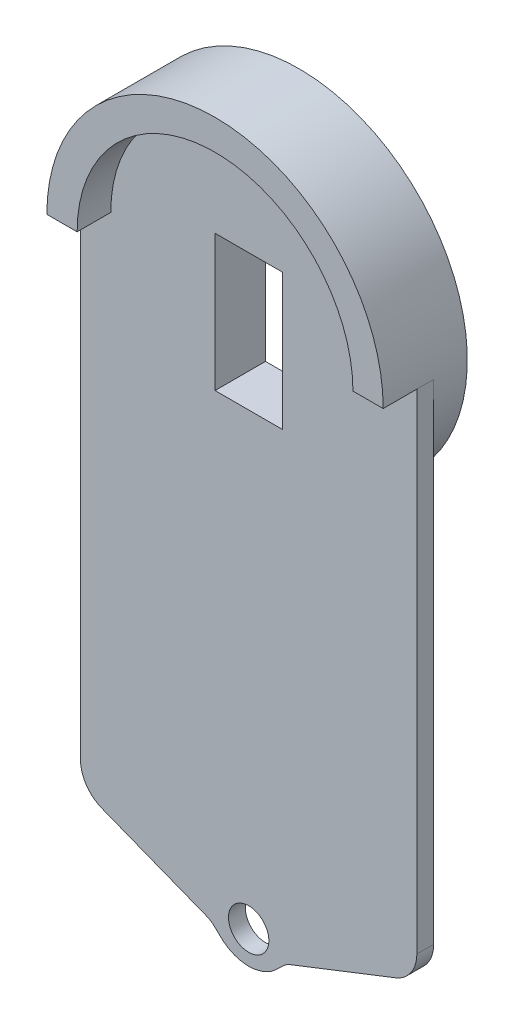
ISO-10303-21;
HEADER;
FILE_DESCRIPTION(('STEP AP214'),'2;1');
FILE_NAME('part.step','',(''),(''),'','','');
FILE_SCHEMA(('AUTOMOTIVE_DESIGN { 1 0 10303 214 1 1 1 1 }'));
ENDSEC;
DATA;
#1=APPLICATION_CONTEXT('core data for automotive mechanical design processes');
#2=APPLICATION_PROTOCOL_DEFINITION('international standard','automotive_design',2000,#1);
#3=PRODUCT_CONTEXT('',#1,'mechanical');
#4=PRODUCT('Part','Part','',(#3));
#5=PRODUCT_RELATED_PRODUCT_CATEGORY('part','',(#4));
#6=PRODUCT_DEFINITION_FORMATION('','',#4);
#7=PRODUCT_DEFINITION_CONTEXT('part definition',#1,'design');
#8=PRODUCT_DEFINITION('design','',#6,#7);
#9=PRODUCT_DEFINITION_SHAPE('','',#8);
#10=(LENGTH_UNIT() NAMED_UNIT(*) SI_UNIT(.MILLI.,.METRE.));
#11=(NAMED_UNIT(*) PLANE_ANGLE_UNIT() SI_UNIT($,.RADIAN.));
#12=(NAMED_UNIT(*) SI_UNIT($,.STERADIAN.) SOLID_ANGLE_UNIT());
#13=UNCERTAINTY_MEASURE_WITH_UNIT(LENGTH_MEASURE(1.E-05),#10,'distance_accuracy_value','');
#14=(GEOMETRIC_REPRESENTATION_CONTEXT(3) GLOBAL_UNCERTAINTY_ASSIGNED_CONTEXT((#13)) GLOBAL_UNIT_ASSIGNED_CONTEXT((#10,
#11,#12)) REPRESENTATION_CONTEXT('',''));
#15=CARTESIAN_POINT('',(0.,0.,0.));
#16=DIRECTION('',(0.,0.,1.));
#17=DIRECTION('',(1.,0.,0.));
#18=AXIS2_PLACEMENT_3D('',#15,#16,#17);
#19=CARTESIAN_POINT('',(0.,0.,0.));
#20=DIRECTION('',(0.,0.,1.));
#21=DIRECTION('',(1.,0.,0.));
#22=AXIS2_PLACEMENT_3D('',#19,#20,#21);
#23=PLANE('',#22);
#24=CARTESIAN_POINT('',(0.,0.,0.));
#25=DIRECTION('',(0.,0.,1.));
#26=DIRECTION('',(1.,0.,0.));
#27=AXIS2_PLACEMENT_3D('',#24,#25,#26);
#28=CIRCLE('',#27,6.00000000000001);
#29=CARTESIAN_POINT('',(6.00000000000001,0.,0.));
#30=VERTEX_POINT('',#29);
#31=EDGE_CURVE('E277',#30,#30,#28,.T.);
#32=ORIENTED_EDGE('',*,*,#31,.T.);
#33=EDGE_LOOP('',(#32));
#34=FACE_BOUND('',#33,.T.);
#35=CARTESIAN_POINT('',(0.,164.,0.));
#36=DIRECTION('',(0.,0.,-1.));
#37=DIRECTION('',(-1.,0.,0.));
#38=AXIS2_PLACEMENT_3D('',#35,#36,#37);
#39=CIRCLE('',#38,50.0000000000001);
#40=CARTESIAN_POINT('',(50.,164.,0.));
#41=VERTEX_POINT('',#40);
#42=CARTESIAN_POINT('',(-50.,164.,0.));
#43=VERTEX_POINT('',#42);
#44=EDGE_CURVE('E11',#41,#43,#39,.T.);
#45=ORIENTED_EDGE('',*,*,#44,.F.);
#46=DIRECTION('',(0.,-1.,0.));
#47=VECTOR('',#46,1.);
#48=CARTESIAN_POINT('',(50.,0.,0.));
#49=LINE('',#48,#47);
#50=CARTESIAN_POINT('',(50.,18.56450634185,0.));
#51=VERTEX_POINT('',#50);
#52=EDGE_CURVE('E352',#41,#51,#49,.T.);
#53=ORIENTED_EDGE('',*,*,#52,.T.);
#54=CARTESIAN_POINT('',(40.,18.56450634185,0.));
#55=DIRECTION('',(0.,0.,1.));
#56=DIRECTION('',(1.,0.,0.));
#57=AXIS2_PLACEMENT_3D('',#54,#55,#56);
#58=CIRCLE('',#57,10.);
#59=CARTESIAN_POINT('',(43.6440211842062,9.25208938334473,0.));
#60=VERTEX_POINT('',#59);
#61=EDGE_CURVE('E305',#51,#60,#58,.F.);
#62=ORIENTED_EDGE('',*,*,#61,.T.);
#63=DIRECTION('',(0.931241695850528,0.364402118420615,0.));
#64=VECTOR('',#63,1.);
#65=CARTESIAN_POINT('',(2.65577807818865,-6.7869289345908,0.));
#66=LINE('',#65,#64);
#67=CARTESIAN_POINT('',(13.7873085421709,-2.43107448733693,0.));
#68=VERTEX_POINT('',#67);
#69=EDGE_CURVE('E346',#68,#60,#66,.T.);
#70=ORIENTED_EDGE('',*,*,#69,.F.);
#71=CARTESIAN_POINT('',(8.85481718103053,-5.67730206584521,0.));
#72=CARTESIAN_POINT('',(9.51760474958754,-5.09034472237551,0.));
#73=CARTESIAN_POINT('',(10.9006542614922,-3.46904784150408,0.));
#74=CARTESIAN_POINT('',(12.7111603175639,-2.85217965748637,0.));
#75=CARTESIAN_POINT('',(13.7873085421709,-2.43107448733693,0.));
#76=B_SPLINE_CURVE_WITH_KNOTS('',3,(#71,#72,#73,#74,#75),.UNSPECIFIED.,.F.,.F.,(4,1,4),
(0.517708820762601,0.74117188397299,1.),.UNSPECIFIED.);
#77=CARTESIAN_POINT('',(8.85481718103053,-5.67730206584521,0.));
#78=VERTEX_POINT('',#77);
#79=EDGE_CURVE('E342',#78,#68,#76,.T.);
#80=ORIENTED_EDGE('',*,*,#79,.F.);
#81=CARTESIAN_POINT('',(0.,2.42159987766087,0.));
#82=DIRECTION('',(0.,0.,1.));
#83=DIRECTION('',(1.,0.,0.));
#84=AXIS2_PLACEMENT_3D('',#81,#82,#83);
#85=CIRCLE('',#84,12.);
#86=CARTESIAN_POINT('',(-8.85481718103054,-5.67730206584521,0.));
#87=VERTEX_POINT('',#86);
#88=EDGE_CURVE('E337',#87,#78,#85,.T.);
#89=ORIENTED_EDGE('',*,*,#88,.F.);
#90=CARTESIAN_POINT('',(-8.85481718103054,-5.67730206584521,0.));
#91=CARTESIAN_POINT('',(-9.51760474958754,-5.0903447223755,0.));
#92=CARTESIAN_POINT('',(-10.9006542614922,-3.46904784150407,0.));
#93=CARTESIAN_POINT('',(-12.7111603175639,-2.85217965748637,0.));
#94=CARTESIAN_POINT('',(-13.7873085421709,-2.43107448733693,0.));
#95=B_SPLINE_CURVE_WITH_KNOTS('',3,(#90,#91,#92,#93,#94),.UNSPECIFIED.,.F.,.F.,(4,1,4),
(0.517708820762602,0.74117188397299,1.),.UNSPECIFIED.);
#96=CARTESIAN_POINT('',(-13.7873085421709,-2.43107448733693,0.));
#97=VERTEX_POINT('',#96);
#98=EDGE_CURVE('E269',#87,#97,#95,.T.);
#99=ORIENTED_EDGE('',*,*,#98,.T.);
#100=DIRECTION('',(-0.931241695850529,0.364402118420615,0.));
#101=VECTOR('',#100,1.);
#102=CARTESIAN_POINT('',(-2.65577807818864,-6.78692893459079,0.));
#103=LINE('',#102,#101);
#104=CARTESIAN_POINT('',(-43.6440211842062,9.2520893833447,0.));
#105=VERTEX_POINT('',#104);
#106=EDGE_CURVE('E357',#97,#105,#103,.T.);
#107=ORIENTED_EDGE('',*,*,#106,.T.);
#108=CARTESIAN_POINT('',(-40.,18.56450634185,0.));
#109=DIRECTION('',(0.,0.,1.));
#110=DIRECTION('',(1.,0.,0.));
#111=AXIS2_PLACEMENT_3D('',#108,#109,#110);
#112=CIRCLE('',#111,10.);
#113=CARTESIAN_POINT('',(-50.,18.56450634185,0.));
#114=VERTEX_POINT('',#113);
#115=EDGE_CURVE('E380',#105,#114,#112,.F.);
#116=ORIENTED_EDGE('',*,*,#115,.T.);
#117=DIRECTION('',(0.,-1.,0.));
#118=VECTOR('',#117,1.);
#119=CARTESIAN_POINT('',(-50.,0.,0.));
#120=LINE('',#119,#118);
#121=EDGE_CURVE('E354',#43,#114,#120,.T.);
#122=ORIENTED_EDGE('',*,*,#121,.F.);
#123=EDGE_LOOP('',(#45,#53,#62,#70,#80,#89,#99,#107,#116,#122));
#124=FACE_BOUND('',#123,.T.);
#125=ADVANCED_FACE('F34',(#34,#124),#23,.F.);
#126=CARTESIAN_POINT('',(40.,18.56450634185,5.));
#127=DIRECTION('',(0.,0.,1.));
#128=DIRECTION('',(1.,0.,0.));
#129=AXIS2_PLACEMENT_3D('',#126,#127,#128);
#130=CYLINDRICAL_SURFACE('',#129,10.);
#131=DIRECTION('',(0.,0.,-1.));
#132=VECTOR('',#131,1.);
#133=CARTESIAN_POINT('',(50.,18.56450634185,5.));
#134=LINE('',#133,#132);
#135=CARTESIAN_POINT('',(50.,18.56450634185,5.));
#136=VERTEX_POINT('',#135);
#137=EDGE_CURVE('E300',#136,#51,#134,.T.);
#138=ORIENTED_EDGE('',*,*,#137,.F.);
#139=CARTESIAN_POINT('',(40.,18.56450634185,5.));
#140=DIRECTION('',(0.,0.,1.));
#141=DIRECTION('',(1.,0.,0.));
#142=AXIS2_PLACEMENT_3D('',#139,#140,#141);
#143=CIRCLE('',#142,10.);
#144=CARTESIAN_POINT('',(43.6440211842062,9.25208938334473,5.));
#145=VERTEX_POINT('',#144);
#146=EDGE_CURVE('E303',#145,#136,#143,.T.);
#147=ORIENTED_EDGE('',*,*,#146,.F.);
#148=DIRECTION('',(0.,0.,-1.));
#149=VECTOR('',#148,1.);
#150=CARTESIAN_POINT('',(43.6440211842062,9.25208938334472,5.));
#151=LINE('',#150,#149);
#152=EDGE_CURVE('E309',#60,#145,#151,.F.);
#153=ORIENTED_EDGE('',*,*,#152,.F.);
#154=ORIENTED_EDGE('',*,*,#61,.F.);
#155=EDGE_LOOP('',(#138,#147,#153,#154));
#156=FACE_BOUND('',#155,.T.);
#157=ADVANCED_FACE('F287',(#156),#130,.T.);
#158=CARTESIAN_POINT('',(-8.85481718103054,-5.67730206584521,5.));
#159=CARTESIAN_POINT('',(-9.51760474958754,-5.0903447223755,5.));
#160=CARTESIAN_POINT('',(-10.9006542614922,-3.46904784150407,5.));
#161=CARTESIAN_POINT('',(-12.7111603175639,-2.85217965748637,5.));
#162=CARTESIAN_POINT('',(-13.7873085421709,-2.43107448733693,5.));
#163=B_SPLINE_CURVE_WITH_KNOTS('',3,(#158,#159,#160,#161,#162),.UNSPECIFIED.,.F.,.F.,(4,1,4),
(0.517708820762602,0.74117188397299,1.),.UNSPECIFIED.);
#164=DIRECTION('',(0.,0.,-1.));
#165=VECTOR('',#164,1.);
#166=SURFACE_OF_LINEAR_EXTRUSION('',#163,#165);
#167=ORIENTED_EDGE('',*,*,#98,.F.);
#168=DIRECTION('',(0.,0.,-1.));
#169=VECTOR('',#168,1.);
#170=CARTESIAN_POINT('',(-8.85481718103054,-5.67730206584521,5.));
#171=LINE('',#170,#169);
#172=CARTESIAN_POINT('',(-8.85481718103054,-5.67730206584521,5.));
#173=VERTEX_POINT('',#172);
#174=EDGE_CURVE('E310',#173,#87,#171,.T.);
#175=ORIENTED_EDGE('',*,*,#174,.F.);
#176=CARTESIAN_POINT('',(-13.7873085421709,-2.43107448733693,5.));
#177=VERTEX_POINT('',#176);
#178=EDGE_CURVE('E270',#173,#177,#163,.T.);
#179=ORIENTED_EDGE('',*,*,#178,.T.);
#180=DIRECTION('',(0.,0.,-1.));
#181=VECTOR('',#180,1.);
#182=CARTESIAN_POINT('',(-13.7873085421709,-2.43107448733693,5.));
#183=LINE('',#182,#181);
#184=EDGE_CURVE('E332',#177,#97,#183,.T.);
#185=ORIENTED_EDGE('',*,*,#184,.T.);
#186=EDGE_LOOP('',(#167,#175,#179,#185));
#187=FACE_BOUND('',#186,.T.);
#188=ADVANCED_FACE('F283',(#187),#166,.T.);
#189=CARTESIAN_POINT('',(0.,2.42159987766087,5.));
#190=DIRECTION('',(0.,0.,-1.));
#191=DIRECTION('',(-1.,0.,0.));
#192=AXIS2_PLACEMENT_3D('',#189,#190,#191);
#193=CYLINDRICAL_SURFACE('',#192,12.);
#194=ORIENTED_EDGE('',*,*,#88,.T.);
#195=DIRECTION('',(0.,0.,-1.));
#196=VECTOR('',#195,1.);
#197=CARTESIAN_POINT('',(8.85481718103053,-5.67730206584521,5.));
#198=LINE('',#197,#196);
#199=CARTESIAN_POINT('',(8.85481718103053,-5.67730206584521,5.));
#200=VERTEX_POINT('',#199);
#201=EDGE_CURVE('E370',#200,#78,#198,.T.);
#202=ORIENTED_EDGE('',*,*,#201,.F.);
#203=CARTESIAN_POINT('',(0.,2.42159987766087,5.));
#204=DIRECTION('',(0.,0.,1.));
#205=DIRECTION('',(1.,0.,0.));
#206=AXIS2_PLACEMENT_3D('',#203,#204,#205);
#207=CIRCLE('',#206,12.);
#208=EDGE_CURVE('E276',#173,#200,#207,.T.);
#209=ORIENTED_EDGE('',*,*,#208,.F.);
#210=ORIENTED_EDGE('',*,*,#174,.T.);
#211=EDGE_LOOP('',(#194,#202,#209,#210));
#212=FACE_BOUND('',#211,.T.);
#213=ADVANCED_FACE('F286',(#212),#193,.T.);
#214=CARTESIAN_POINT('',(8.85481718103053,-5.67730206584521,5.));
#215=CARTESIAN_POINT('',(9.51760474958754,-5.09034472237551,5.));
#216=CARTESIAN_POINT('',(10.9006542614922,-3.46904784150408,5.));
#217=CARTESIAN_POINT('',(12.7111603175639,-2.85217965748637,5.));
#218=CARTESIAN_POINT('',(13.7873085421709,-2.43107448733693,5.));
#219=B_SPLINE_CURVE_WITH_KNOTS('',3,(#214,#215,#216,#217,#218),.UNSPECIFIED.,.F.,.F.,(4,1,4),
(0.517708820762601,0.74117188397299,1.),.UNSPECIFIED.);
#220=DIRECTION('',(0.,0.,-1.));
#221=VECTOR('',#220,1.);
#222=SURFACE_OF_LINEAR_EXTRUSION('',#219,#221);
#223=ORIENTED_EDGE('',*,*,#79,.T.);
#224=DIRECTION('',(0.,0.,-1.));
#225=VECTOR('',#224,1.);
#226=CARTESIAN_POINT('',(13.7873085421709,-2.43107448733693,5.));
#227=LINE('',#226,#225);
#228=CARTESIAN_POINT('',(13.7873085421709,-2.43107448733693,5.));
#229=VERTEX_POINT('',#228);
#230=EDGE_CURVE('E367',#229,#68,#227,.T.);
#231=ORIENTED_EDGE('',*,*,#230,.F.);
#232=EDGE_CURVE('E324',#200,#229,#219,.T.);
#233=ORIENTED_EDGE('',*,*,#232,.F.);
#234=ORIENTED_EDGE('',*,*,#201,.T.);
#235=EDGE_LOOP('',(#223,#231,#233,#234));
#236=FACE_BOUND('',#235,.T.);
#237=ADVANCED_FACE('F444',(#236),#222,.F.);
#238=CARTESIAN_POINT('',(2.65577807818865,-6.7869289345908,5.));
#239=DIRECTION('',(-0.364402118420615,0.931241695850528,0.));
#240=DIRECTION('',(-0.931241695850528,-0.364402118420615,0.));
#241=AXIS2_PLACEMENT_3D('',#238,#239,#240);
#242=PLANE('',#241);
#243=ORIENTED_EDGE('',*,*,#69,.T.);
#244=ORIENTED_EDGE('',*,*,#152,.T.);
#245=DIRECTION('',(0.931241695850528,0.364402118420615,0.));
#246=VECTOR('',#245,1.);
#247=CARTESIAN_POINT('',(2.65577807818865,-6.7869289345908,5.));
#248=LINE('',#247,#246);
#249=EDGE_CURVE('E318',#229,#145,#248,.T.);
#250=ORIENTED_EDGE('',*,*,#249,.F.);
#251=ORIENTED_EDGE('',*,*,#230,.T.);
#252=EDGE_LOOP('',(#243,#244,#250,#251));
#253=FACE_BOUND('',#252,.T.);
#254=ADVANCED_FACE('F442',(#253),#242,.F.);
#255=CARTESIAN_POINT('',(50.,0.,5.));
#256=DIRECTION('',(1.,0.,0.));
#257=DIRECTION('',(0.,0.,-1.));
#258=AXIS2_PLACEMENT_3D('',#255,#256,#257);
#259=PLANE('',#258);
#260=DIRECTION('',(0.,-1.,0.));
#261=VECTOR('',#260,1.);
#262=CARTESIAN_POINT('',(50.,0.,5.));
#263=LINE('',#262,#261);
#264=CARTESIAN_POINT('',(50.,164.,5.));
#265=VERTEX_POINT('',#264);
#266=EDGE_CURVE('E313',#265,#136,#263,.T.);
#267=ORIENTED_EDGE('',*,*,#266,.T.);
#268=ORIENTED_EDGE('',*,*,#137,.T.);
#269=ORIENTED_EDGE('',*,*,#52,.F.);
#270=DIRECTION('',(0.,0.,-1.));
#271=VECTOR('',#270,1.);
#272=CARTESIAN_POINT('',(50.,164.,5.));
#273=LINE('',#272,#271);
#274=EDGE_CURVE('E316',#265,#41,#273,.T.);
#275=ORIENTED_EDGE('',*,*,#274,.F.);
#276=EDGE_LOOP('',(#267,#268,#269,#275));
#277=FACE_BOUND('',#276,.T.);
#278=ADVANCED_FACE('F314',(#277),#259,.T.);
#279=CARTESIAN_POINT('',(0.,164.,5.));
#280=DIRECTION('',(0.,0.,-1.));
#281=DIRECTION('',(-1.,0.,0.));
#282=AXIS2_PLACEMENT_3D('',#279,#280,#281);
#283=CYLINDRICAL_SURFACE('',#282,50.);
#284=DIRECTION('',(0.,0.,-1.));
#285=VECTOR('',#284,1.);
#286=CARTESIAN_POINT('',(-50.,164.,5.));
#287=LINE('',#286,#285);
#288=CARTESIAN_POINT('',(-50.,164.,5.));
#289=VERTEX_POINT('',#288);
#290=EDGE_CURVE('E363',#289,#43,#287,.T.);
#291=ORIENTED_EDGE('',*,*,#290,.F.);
#292=DIRECTION('',(0.,0.,1.));
#293=VECTOR('',#292,1.);
#294=CARTESIAN_POINT('',(-50.,164.,5.));
#295=LINE('',#294,#293);
#296=CARTESIAN_POINT('',(-50.,164.,15.));
#297=VERTEX_POINT('',#296);
#298=EDGE_CURVE('E246',#289,#297,#295,.T.);
#299=ORIENTED_EDGE('',*,*,#298,.T.);
#300=CARTESIAN_POINT('',(0.,164.,15.));
#301=DIRECTION('',(0.,0.,1.));
#302=DIRECTION('',(1.,0.,0.));
#303=AXIS2_PLACEMENT_3D('',#300,#301,#302);
#304=CIRCLE('',#303,50.);
#305=CARTESIAN_POINT('',(50.,164.,15.));
#306=VERTEX_POINT('',#305);
#307=EDGE_CURVE('E265',#306,#297,#304,.T.);
#308=ORIENTED_EDGE('',*,*,#307,.F.);
#309=DIRECTION('',(0.,0.,1.));
#310=VECTOR('',#309,1.);
#311=CARTESIAN_POINT('',(50.,164.,5.));
#312=LINE('',#311,#310);
#313=EDGE_CURVE('E243',#265,#306,#312,.T.);
#314=ORIENTED_EDGE('',*,*,#313,.F.);
#315=ORIENTED_EDGE('',*,*,#274,.T.);
#316=ORIENTED_EDGE('',*,*,#44,.T.);
#317=EDGE_LOOP('',(#291,#299,#308,#314,#315,#316));
#318=FACE_BOUND('',#317,.T.);
#319=CARTESIAN_POINT('',(0.,164.,-10.));
#320=DIRECTION('',(0.,0.,-1.));
#321=DIRECTION('',(-1.,0.,0.));
#322=AXIS2_PLACEMENT_3D('',#319,#320,#321);
#323=CIRCLE('',#322,50.0000000000001);
#324=CARTESIAN_POINT('',(-50.,164.,-10.));
#325=VERTEX_POINT('',#324);
#326=EDGE_CURVE('E234',#325,#325,#323,.T.);
#327=ORIENTED_EDGE('',*,*,#326,.F.);
#328=EDGE_LOOP('',(#327));
#329=FACE_BOUND('',#328,.T.);
#330=ADVANCED_FACE('F435',(#318,#329),#283,.T.);
#331=CARTESIAN_POINT('',(-50.,0.,5.));
#332=DIRECTION('',(1.,0.,0.));
#333=DIRECTION('',(0.,1.,0.));
#334=AXIS2_PLACEMENT_3D('',#331,#332,#333);
#335=PLANE('',#334);
#336=ORIENTED_EDGE('',*,*,#121,.T.);
#337=DIRECTION('',(0.,0.,-1.));
#338=VECTOR('',#337,1.);
#339=CARTESIAN_POINT('',(-50.,18.56450634185,5.));
#340=LINE('',#339,#338);
#341=CARTESIAN_POINT('',(-50.,18.56450634185,5.));
#342=VERTEX_POINT('',#341);
#343=EDGE_CURVE('E382',#114,#342,#340,.F.);
#344=ORIENTED_EDGE('',*,*,#343,.T.);
#345=DIRECTION('',(0.,-1.,0.));
#346=VECTOR('',#345,1.);
#347=CARTESIAN_POINT('',(-50.,0.,5.));
#348=LINE('',#347,#346);
#349=EDGE_CURVE('E317',#289,#342,#348,.T.);
#350=ORIENTED_EDGE('',*,*,#349,.F.);
#351=ORIENTED_EDGE('',*,*,#290,.T.);
#352=EDGE_LOOP('',(#336,#344,#350,#351));
#353=FACE_BOUND('',#352,.T.);
#354=ADVANCED_FACE('F431',(#353),#335,.F.);
#355=CARTESIAN_POINT('',(-2.65577807818864,-6.78692893459079,5.));
#356=DIRECTION('',(-0.364402118420615,-0.931241695850529,0.));
#357=DIRECTION('',(0.931241695850529,-0.364402118420615,0.));
#358=AXIS2_PLACEMENT_3D('',#355,#356,#357);
#359=PLANE('',#358);
#360=DIRECTION('',(-0.931241695850529,0.364402118420615,0.));
#361=VECTOR('',#360,1.);
#362=CARTESIAN_POINT('',(-2.65577807818864,-6.78692893459079,5.));
#363=LINE('',#362,#361);
#364=CARTESIAN_POINT('',(-43.6440211842062,9.2520893833447,5.));
#365=VERTEX_POINT('',#364);
#366=EDGE_CURVE('E321',#177,#365,#363,.T.);
#367=ORIENTED_EDGE('',*,*,#366,.T.);
#368=DIRECTION('',(0.,0.,-1.));
#369=VECTOR('',#368,1.);
#370=CARTESIAN_POINT('',(-43.6440211842062,9.2520893833447,0.));
#371=LINE('',#370,#369);
#372=EDGE_CURVE('E377',#365,#105,#371,.T.);
#373=ORIENTED_EDGE('',*,*,#372,.T.);
#374=ORIENTED_EDGE('',*,*,#106,.F.);
#375=ORIENTED_EDGE('',*,*,#184,.F.);
#376=EDGE_LOOP('',(#367,#373,#374,#375));
#377=FACE_BOUND('',#376,.T.);
#378=ADVANCED_FACE('F427',(#377),#359,.T.);
#379=CARTESIAN_POINT('',(0.,0.,5.));
#380=DIRECTION('',(0.,0.,-1.));
#381=DIRECTION('',(-1.,0.,0.));
#382=AXIS2_PLACEMENT_3D('',#379,#380,#381);
#383=CYLINDRICAL_SURFACE('',#382,6.00000000000001);
#384=CARTESIAN_POINT('',(0.,0.,5.));
#385=DIRECTION('',(0.,0.,1.));
#386=DIRECTION('',(1.,0.,0.));
#387=AXIS2_PLACEMENT_3D('',#384,#385,#386);
#388=CIRCLE('',#387,6.00000000000001);
#389=CARTESIAN_POINT('',(6.00000000000001,0.,5.));
#390=VERTEX_POINT('',#389);
#391=EDGE_CURVE('E329',#390,#390,#388,.T.);
#392=ORIENTED_EDGE('',*,*,#391,.T.);
#393=EDGE_LOOP('',(#392));
#394=FACE_BOUND('',#393,.T.);
#395=ORIENTED_EDGE('',*,*,#31,.F.);
#396=EDGE_LOOP('',(#395));
#397=FACE_BOUND('',#396,.T.);
#398=ADVANCED_FACE('F421',(#394,#397),#383,.F.);
#399=CARTESIAN_POINT('',(0.,0.,5.));
#400=DIRECTION('',(0.,0.,1.));
#401=DIRECTION('',(1.,0.,0.));
#402=AXIS2_PLACEMENT_3D('',#399,#400,#401);
#403=PLANE('',#402);
#404=ORIENTED_EDGE('',*,*,#266,.F.);
#405=DIRECTION('',(-1.,0.,0.));
#406=VECTOR('',#405,1.);
#407=CARTESIAN_POINT('',(41.,164.,5.));
#408=LINE('',#407,#406);
#409=CARTESIAN_POINT('',(41.,164.,5.));
#410=VERTEX_POINT('',#409);
#411=EDGE_CURVE('E58',#265,#410,#408,.T.);
#412=ORIENTED_EDGE('',*,*,#411,.T.);
#413=CARTESIAN_POINT('',(0.,164.,5.));
#414=DIRECTION('',(0.,0.,1.));
#415=DIRECTION('',(1.,0.,0.));
#416=AXIS2_PLACEMENT_3D('',#413,#414,#415);
#417=CIRCLE('',#416,41.);
#418=CARTESIAN_POINT('',(-41.,164.,5.));
#419=VERTEX_POINT('',#418);
#420=EDGE_CURVE('E258',#410,#419,#417,.T.);
#421=ORIENTED_EDGE('',*,*,#420,.T.);
#422=DIRECTION('',(-1.,0.,0.));
#423=VECTOR('',#422,1.);
#424=CARTESIAN_POINT('',(-41.,164.,5.));
#425=LINE('',#424,#423);
#426=EDGE_CURVE('E239',#419,#289,#425,.T.);
#427=ORIENTED_EDGE('',*,*,#426,.T.);
#428=ORIENTED_EDGE('',*,*,#349,.T.);
#429=CARTESIAN_POINT('',(-40.,18.56450634185,5.));
#430=DIRECTION('',(0.,0.,1.));
#431=DIRECTION('',(1.,0.,0.));
#432=AXIS2_PLACEMENT_3D('',#429,#430,#431);
#433=CIRCLE('',#432,10.);
#434=EDGE_CURVE('E384',#342,#365,#433,.T.);
#435=ORIENTED_EDGE('',*,*,#434,.T.);
#436=ORIENTED_EDGE('',*,*,#366,.F.);
#437=ORIENTED_EDGE('',*,*,#178,.F.);
#438=ORIENTED_EDGE('',*,*,#208,.T.);
#439=ORIENTED_EDGE('',*,*,#232,.T.);
#440=ORIENTED_EDGE('',*,*,#249,.T.);
#441=ORIENTED_EDGE('',*,*,#146,.T.);
#442=EDGE_LOOP('',(#404,#412,#421,#427,#428,#435,#436,#437,#438,#439,#440,#441));
#443=FACE_BOUND('',#442,.T.);
#444=ORIENTED_EDGE('',*,*,#391,.F.);
#445=EDGE_LOOP('',(#444));
#446=FACE_BOUND('',#445,.T.);
#447=DIRECTION('',(0.,1.,0.));
#448=VECTOR('',#447,1.);
#449=CARTESIAN_POINT('',(9.99999999999951,0.,5.));
#450=LINE('',#449,#448);
#451=CARTESIAN_POINT('',(9.99999999999999,133.641101056459,5.));
#452=VERTEX_POINT('',#451);
#453=CARTESIAN_POINT('',(10.0000000000001,174.141101056459,5.));
#454=VERTEX_POINT('',#453);
#455=EDGE_CURVE('E38',#452,#454,#450,.T.);
#456=ORIENTED_EDGE('',*,*,#455,.F.);
#457=DIRECTION('',(1.,0.,0.));
#458=VECTOR('',#457,1.);
#459=CARTESIAN_POINT('',(5.5639285285927E-13,133.641101056459,5.));
#460=LINE('',#459,#458);
#461=CARTESIAN_POINT('',(-10.,133.64110105646,5.));
#462=VERTEX_POINT('',#461);
#463=EDGE_CURVE('E187',#462,#452,#460,.T.);
#464=ORIENTED_EDGE('',*,*,#463,.F.);
#465=DIRECTION('',(0.,-1.,0.));
#466=VECTOR('',#465,1.);
#467=CARTESIAN_POINT('',(-10.0000000000005,0.,5.));
#468=LINE('',#467,#466);
#469=CARTESIAN_POINT('',(-9.99999999999987,174.14110105646,5.));
#470=VERTEX_POINT('',#469);
#471=EDGE_CURVE('E387',#470,#462,#468,.T.);
#472=ORIENTED_EDGE('',*,*,#471,.F.);
#473=DIRECTION('',(-1.,0.,0.));
#474=VECTOR('',#473,1.);
#475=CARTESIAN_POINT('',(4.83338649816144E-13,174.141101056459,5.));
#476=LINE('',#475,#474);
#477=EDGE_CURVE('E389',#454,#470,#476,.T.);
#478=ORIENTED_EDGE('',*,*,#477,.F.);
#479=EDGE_LOOP('',(#456,#464,#472,#478));
#480=FACE_BOUND('',#479,.T.);
#481=ADVANCED_FACE('F396',(#443,#446,#480),#403,.T.);
#482=DIRECTION('',(1.,0.,0.));
#483=VECTOR('',#482,1.);
#484=CARTESIAN_POINT('',(10.0000000000001,174.141101056459,0.));
#485=LINE('',#484,#483);
#486=CARTESIAN_POINT('',(-7.99999999999986,174.14110105646,0.));
#487=VERTEX_POINT('',#486);
#488=CARTESIAN_POINT('',(8.00000000000014,174.141101056459,0.));
#489=VERTEX_POINT('',#488);
#490=EDGE_CURVE('E191',#487,#489,#485,.T.);
#491=ORIENTED_EDGE('',*,*,#490,.F.);
#492=DIRECTION('',(0.,1.,0.));
#493=VECTOR('',#492,1.);
#494=CARTESIAN_POINT('',(-7.99999999999986,194.14110105646,0.));
#495=LINE('',#494,#493);
#496=CARTESIAN_POINT('',(-7.99999999999986,194.14110105646,0.));
#497=VERTEX_POINT('',#496);
#498=EDGE_CURVE('E220',#487,#497,#495,.T.);
#499=ORIENTED_EDGE('',*,*,#498,.T.);
#500=DIRECTION('',(1.,0.,0.));
#501=VECTOR('',#500,1.);
#502=CARTESIAN_POINT('',(8.00000000000014,194.14110105646,0.));
#503=LINE('',#502,#501);
#504=CARTESIAN_POINT('',(8.00000000000014,194.14110105646,0.));
#505=VERTEX_POINT('',#504);
#506=EDGE_CURVE('E223',#497,#505,#503,.T.);
#507=ORIENTED_EDGE('',*,*,#506,.T.);
#508=DIRECTION('',(0.,-1.,0.));
#509=VECTOR('',#508,1.);
#510=CARTESIAN_POINT('',(8.00000000000014,194.14110105646,0.));
#511=LINE('',#510,#509);
#512=EDGE_CURVE('E201',#505,#489,#511,.T.);
#513=ORIENTED_EDGE('',*,*,#512,.T.);
#514=EDGE_LOOP('',(#491,#499,#507,#513));
#515=FACE_BOUND('',#514,.T.);
#516=ADVANCED_FACE('F297',(#515),#23,.F.);
#517=CARTESIAN_POINT('',(-40.,18.56450634185,5.));
#518=DIRECTION('',(0.,0.,1.));
#519=DIRECTION('',(1.,0.,0.));
#520=AXIS2_PLACEMENT_3D('',#517,#518,#519);
#521=CYLINDRICAL_SURFACE('',#520,10.);
#522=ORIENTED_EDGE('',*,*,#434,.F.);
#523=ORIENTED_EDGE('',*,*,#343,.F.);
#524=ORIENTED_EDGE('',*,*,#115,.F.);
#525=ORIENTED_EDGE('',*,*,#372,.F.);
#526=EDGE_LOOP('',(#522,#523,#524,#525));
#527=FACE_BOUND('',#526,.T.);
#528=ADVANCED_FACE('F36',(#527),#521,.T.);
#529=CARTESIAN_POINT('',(0.,164.,15.));
#530=DIRECTION('',(0.,0.,1.));
#531=DIRECTION('',(1.,0.,0.));
#532=AXIS2_PLACEMENT_3D('',#529,#530,#531);
#533=PLANE('',#532);
#534=DIRECTION('',(-1.,0.,0.));
#535=VECTOR('',#534,1.);
#536=CARTESIAN_POINT('',(-41.,164.,15.));
#537=LINE('',#536,#535);
#538=CARTESIAN_POINT('',(-41.,164.,15.));
#539=VERTEX_POINT('',#538);
#540=EDGE_CURVE('E240',#539,#297,#537,.T.);
#541=ORIENTED_EDGE('',*,*,#540,.F.);
#542=CARTESIAN_POINT('',(0.,164.,15.));
#543=DIRECTION('',(0.,0.,1.));
#544=DIRECTION('',(1.,0.,0.));
#545=AXIS2_PLACEMENT_3D('',#542,#543,#544);
#546=CIRCLE('',#545,41.);
#547=CARTESIAN_POINT('',(41.,164.,15.));
#548=VERTEX_POINT('',#547);
#549=EDGE_CURVE('E262',#548,#539,#546,.T.);
#550=ORIENTED_EDGE('',*,*,#549,.F.);
#551=DIRECTION('',(-1.,0.,0.));
#552=VECTOR('',#551,1.);
#553=CARTESIAN_POINT('',(41.,164.,15.));
#554=LINE('',#553,#552);
#555=EDGE_CURVE('E236',#306,#548,#554,.T.);
#556=ORIENTED_EDGE('',*,*,#555,.F.);
#557=ORIENTED_EDGE('',*,*,#307,.T.);
#558=EDGE_LOOP('',(#541,#550,#556,#557));
#559=FACE_BOUND('',#558,.T.);
#560=ADVANCED_FACE('F419',(#559),#533,.T.);
#561=CARTESIAN_POINT('',(0.,164.,15.));
#562=DIRECTION('',(0.,0.,-1.));
#563=DIRECTION('',(-1.,0.,0.));
#564=AXIS2_PLACEMENT_3D('',#561,#562,#563);
#565=CYLINDRICAL_SURFACE('',#564,41.);
#566=DIRECTION('',(0.,0.,1.));
#567=VECTOR('',#566,1.);
#568=CARTESIAN_POINT('',(-41.,164.,5.));
#569=LINE('',#568,#567);
#570=EDGE_CURVE('E249',#419,#539,#569,.T.);
#571=ORIENTED_EDGE('',*,*,#570,.F.);
#572=ORIENTED_EDGE('',*,*,#420,.F.);
#573=DIRECTION('',(0.,0.,1.));
#574=VECTOR('',#573,1.);
#575=CARTESIAN_POINT('',(41.,164.,5.));
#576=LINE('',#575,#574);
#577=EDGE_CURVE('E251',#410,#548,#576,.T.);
#578=ORIENTED_EDGE('',*,*,#577,.T.);
#579=ORIENTED_EDGE('',*,*,#549,.T.);
#580=EDGE_LOOP('',(#571,#572,#578,#579));
#581=FACE_BOUND('',#580,.T.);
#582=ADVANCED_FACE('F479',(#581),#565,.F.);
#583=CARTESIAN_POINT('',(9.99999999999999,133.641101056459,10.));
#584=DIRECTION('',(1.,0.,0.));
#585=DIRECTION('',(0.,1.,0.));
#586=AXIS2_PLACEMENT_3D('',#583,#584,#585);
#587=PLANE('',#586);
#588=ORIENTED_EDGE('',*,*,#455,.T.);
#589=DIRECTION('',(0.,0.,-1.));
#590=VECTOR('',#589,1.);
#591=CARTESIAN_POINT('',(10.0000000000001,174.141101056459,10.));
#592=LINE('',#591,#590);
#593=CARTESIAN_POINT('',(10.0000000000001,174.141101056459,-10.));
#594=VERTEX_POINT('',#593);
#595=EDGE_CURVE('E197',#454,#594,#592,.T.);
#596=ORIENTED_EDGE('',*,*,#595,.T.);
#597=DIRECTION('',(0.,-1.,0.));
#598=VECTOR('',#597,1.);
#599=CARTESIAN_POINT('',(9.99999999999999,133.641101056459,-10.));
#600=LINE('',#599,#598);
#601=CARTESIAN_POINT('',(9.99999999999999,133.641101056459,-10.));
#602=VERTEX_POINT('',#601);
#603=EDGE_CURVE('E194',#594,#602,#600,.T.);
#604=ORIENTED_EDGE('',*,*,#603,.T.);
#605=DIRECTION('',(0.,0.,-1.));
#606=VECTOR('',#605,1.);
#607=CARTESIAN_POINT('',(9.99999999999999,133.641101056459,10.));
#608=LINE('',#607,#606);
#609=EDGE_CURVE('E180',#452,#602,#608,.T.);
#610=ORIENTED_EDGE('',*,*,#609,.F.);
#611=EDGE_LOOP('',(#588,#596,#604,#610));
#612=FACE_BOUND('',#611,.T.);
#613=ADVANCED_FACE('F195',(#612),#587,.F.);
#614=CARTESIAN_POINT('',(10.0000000000001,174.141101056459,10.));
#615=DIRECTION('',(0.,1.,0.));
#616=DIRECTION('',(-1.,0.,0.));
#617=AXIS2_PLACEMENT_3D('',#614,#615,#616);
#618=PLANE('',#617);
#619=ORIENTED_EDGE('',*,*,#477,.T.);
#620=DIRECTION('',(0.,0.,-1.));
#621=VECTOR('',#620,1.);
#622=CARTESIAN_POINT('',(-9.99999999999987,174.14110105646,10.));
#623=LINE('',#622,#621);
#624=CARTESIAN_POINT('',(-9.99999999999987,174.14110105646,-10.));
#625=VERTEX_POINT('',#624);
#626=EDGE_CURVE('E259',#470,#625,#623,.T.);
#627=ORIENTED_EDGE('',*,*,#626,.T.);
#628=DIRECTION('',(1.,0.,0.));
#629=VECTOR('',#628,1.);
#630=CARTESIAN_POINT('',(-7.99999999999986,174.14110105646,-10.));
#631=LINE('',#630,#629);
#632=CARTESIAN_POINT('',(-7.99999999999986,174.14110105646,-10.));
#633=VERTEX_POINT('',#632);
#634=EDGE_CURVE('E208',#625,#633,#631,.T.);
#635=ORIENTED_EDGE('',*,*,#634,.T.);
#636=DIRECTION('',(0.,0.,1.));
#637=VECTOR('',#636,1.);
#638=CARTESIAN_POINT('',(-7.99999999999986,174.14110105646,-10.));
#639=LINE('',#638,#637);
#640=EDGE_CURVE('E232',#633,#487,#639,.T.);
#641=ORIENTED_EDGE('',*,*,#640,.T.);
#642=ORIENTED_EDGE('',*,*,#490,.T.);
#643=DIRECTION('',(0.,0.,1.));
#644=VECTOR('',#643,1.);
#645=CARTESIAN_POINT('',(8.00000000000014,174.141101056459,-10.));
#646=LINE('',#645,#644);
#647=CARTESIAN_POINT('',(8.00000000000014,174.141101056459,-10.));
#648=VERTEX_POINT('',#647);
#649=EDGE_CURVE('E50',#648,#489,#646,.T.);
#650=ORIENTED_EDGE('',*,*,#649,.F.);
#651=DIRECTION('',(1.,0.,0.));
#652=VECTOR('',#651,1.);
#653=CARTESIAN_POINT('',(10.0000000000001,174.141101056459,-10.));
#654=LINE('',#653,#652);
#655=EDGE_CURVE('E218',#648,#594,#654,.T.);
#656=ORIENTED_EDGE('',*,*,#655,.T.);
#657=ORIENTED_EDGE('',*,*,#595,.F.);
#658=EDGE_LOOP('',(#619,#627,#635,#641,#642,#650,#656,#657));
#659=FACE_BOUND('',#658,.T.);
#660=ADVANCED_FACE('F394',(#659),#618,.F.);
#661=CARTESIAN_POINT('',(-9.99999999999987,174.14110105646,10.));
#662=DIRECTION('',(-1.,0.,0.));
#663=DIRECTION('',(0.,-1.,0.));
#664=AXIS2_PLACEMENT_3D('',#661,#662,#663);
#665=PLANE('',#664);
#666=ORIENTED_EDGE('',*,*,#471,.T.);
#667=DIRECTION('',(0.,0.,-1.));
#668=VECTOR('',#667,1.);
#669=CARTESIAN_POINT('',(-10.,133.64110105646,10.));
#670=LINE('',#669,#668);
#671=CARTESIAN_POINT('',(-10.,133.64110105646,-10.));
#672=VERTEX_POINT('',#671);
#673=EDGE_CURVE('E190',#462,#672,#670,.T.);
#674=ORIENTED_EDGE('',*,*,#673,.T.);
#675=DIRECTION('',(0.,1.,0.));
#676=VECTOR('',#675,1.);
#677=CARTESIAN_POINT('',(-9.99999999999987,174.14110105646,-10.));
#678=LINE('',#677,#676);
#679=EDGE_CURVE('E206',#672,#625,#678,.T.);
#680=ORIENTED_EDGE('',*,*,#679,.T.);
#681=ORIENTED_EDGE('',*,*,#626,.F.);
#682=EDGE_LOOP('',(#666,#674,#680,#681));
#683=FACE_BOUND('',#682,.T.);
#684=ADVANCED_FACE('F398',(#683),#665,.F.);
#685=CARTESIAN_POINT('',(-10.,133.64110105646,10.));
#686=DIRECTION('',(0.,-1.,0.));
#687=DIRECTION('',(1.,0.,0.));
#688=AXIS2_PLACEMENT_3D('',#685,#686,#687);
#689=PLANE('',#688);
#690=ORIENTED_EDGE('',*,*,#463,.T.);
#691=ORIENTED_EDGE('',*,*,#609,.T.);
#692=DIRECTION('',(-1.,0.,0.));
#693=VECTOR('',#692,1.);
#694=CARTESIAN_POINT('',(-10.,133.64110105646,-10.));
#695=LINE('',#694,#693);
#696=EDGE_CURVE('E184',#602,#672,#695,.T.);
#697=ORIENTED_EDGE('',*,*,#696,.T.);
#698=ORIENTED_EDGE('',*,*,#673,.F.);
#699=EDGE_LOOP('',(#690,#691,#697,#698));
#700=FACE_BOUND('',#699,.T.);
#701=ADVANCED_FACE('F182',(#700),#689,.F.);
#702=CARTESIAN_POINT('',(-41.,164.,5.));
#703=DIRECTION('',(0.,1.,0.));
#704=DIRECTION('',(0.,0.,1.));
#705=AXIS2_PLACEMENT_3D('',#702,#703,#704);
#706=PLANE('',#705);
#707=ORIENTED_EDGE('',*,*,#540,.T.);
#708=ORIENTED_EDGE('',*,*,#298,.F.);
#709=ORIENTED_EDGE('',*,*,#426,.F.);
#710=ORIENTED_EDGE('',*,*,#570,.T.);
#711=EDGE_LOOP('',(#707,#708,#709,#710));
#712=FACE_BOUND('',#711,.T.);
#713=ADVANCED_FACE('F488',(#712),#706,.F.);
#714=CARTESIAN_POINT('',(41.,164.,5.));
#715=DIRECTION('',(0.,1.,0.));
#716=DIRECTION('',(0.,0.,1.));
#717=AXIS2_PLACEMENT_3D('',#714,#715,#716);
#718=PLANE('',#717);
#719=ORIENTED_EDGE('',*,*,#555,.T.);
#720=ORIENTED_EDGE('',*,*,#577,.F.);
#721=ORIENTED_EDGE('',*,*,#411,.F.);
#722=ORIENTED_EDGE('',*,*,#313,.T.);
#723=EDGE_LOOP('',(#719,#720,#721,#722));
#724=FACE_BOUND('',#723,.T.);
#725=ADVANCED_FACE('F473',(#724),#718,.F.);
#726=CARTESIAN_POINT('',(0.,164.,-10.));
#727=DIRECTION('',(0.,0.,-1.));
#728=DIRECTION('',(-1.,0.,0.));
#729=AXIS2_PLACEMENT_3D('',#726,#727,#728);
#730=PLANE('',#729);
#731=ORIENTED_EDGE('',*,*,#326,.T.);
#732=EDGE_LOOP('',(#731));
#733=FACE_BOUND('',#732,.T.);
#734=ORIENTED_EDGE('',*,*,#696,.F.);
#735=ORIENTED_EDGE('',*,*,#603,.F.);
#736=ORIENTED_EDGE('',*,*,#655,.F.);
#737=DIRECTION('',(0.,-1.,0.));
#738=VECTOR('',#737,1.);
#739=CARTESIAN_POINT('',(8.00000000000014,194.14110105646,-10.));
#740=LINE('',#739,#738);
#741=CARTESIAN_POINT('',(8.00000000000014,194.14110105646,-10.));
#742=VERTEX_POINT('',#741);
#743=EDGE_CURVE('E216',#742,#648,#740,.T.);
#744=ORIENTED_EDGE('',*,*,#743,.F.);
#745=DIRECTION('',(1.,0.,0.));
#746=VECTOR('',#745,1.);
#747=CARTESIAN_POINT('',(8.00000000000014,194.14110105646,-10.));
#748=LINE('',#747,#746);
#749=CARTESIAN_POINT('',(-7.99999999999986,194.14110105646,-10.));
#750=VERTEX_POINT('',#749);
#751=EDGE_CURVE('E214',#750,#742,#748,.T.);
#752=ORIENTED_EDGE('',*,*,#751,.F.);
#753=DIRECTION('',(0.,1.,0.));
#754=VECTOR('',#753,1.);
#755=CARTESIAN_POINT('',(-7.99999999999986,194.14110105646,-10.));
#756=LINE('',#755,#754);
#757=EDGE_CURVE('E212',#633,#750,#756,.T.);
#758=ORIENTED_EDGE('',*,*,#757,.F.);
#759=ORIENTED_EDGE('',*,*,#634,.F.);
#760=ORIENTED_EDGE('',*,*,#679,.F.);
#761=EDGE_LOOP('',(#734,#735,#736,#744,#752,#758,#759,#760));
#762=FACE_BOUND('',#761,.T.);
#763=ADVANCED_FACE('F203',(#733,#762),#730,.T.);
#764=CARTESIAN_POINT('',(-7.99999999999986,194.14110105646,-10.));
#765=DIRECTION('',(1.,0.,0.));
#766=DIRECTION('',(0.,0.,-1.));
#767=AXIS2_PLACEMENT_3D('',#764,#765,#766);
#768=PLANE('',#767);
#769=ORIENTED_EDGE('',*,*,#498,.F.);
#770=ORIENTED_EDGE('',*,*,#640,.F.);
#771=ORIENTED_EDGE('',*,*,#757,.T.);
#772=DIRECTION('',(0.,0.,1.));
#773=VECTOR('',#772,1.);
#774=CARTESIAN_POINT('',(-7.99999999999986,194.14110105646,-10.));
#775=LINE('',#774,#773);
#776=EDGE_CURVE('E230',#750,#497,#775,.T.);
#777=ORIENTED_EDGE('',*,*,#776,.T.);
#778=EDGE_LOOP('',(#769,#770,#771,#777));
#779=FACE_BOUND('',#778,.T.);
#780=ADVANCED_FACE('F403',(#779),#768,.T.);
#781=CARTESIAN_POINT('',(8.00000000000014,194.14110105646,-10.));
#782=DIRECTION('',(0.,-1.,0.));
#783=DIRECTION('',(0.,0.,-1.));
#784=AXIS2_PLACEMENT_3D('',#781,#782,#783);
#785=PLANE('',#784);
#786=ORIENTED_EDGE('',*,*,#506,.F.);
#787=ORIENTED_EDGE('',*,*,#776,.F.);
#788=ORIENTED_EDGE('',*,*,#751,.T.);
#789=DIRECTION('',(0.,0.,1.));
#790=VECTOR('',#789,1.);
#791=CARTESIAN_POINT('',(8.00000000000014,194.14110105646,-10.));
#792=LINE('',#791,#790);
#793=EDGE_CURVE('E228',#742,#505,#792,.T.);
#794=ORIENTED_EDGE('',*,*,#793,.T.);
#795=EDGE_LOOP('',(#786,#787,#788,#794));
#796=FACE_BOUND('',#795,.T.);
#797=ADVANCED_FACE('F411',(#796),#785,.T.);
#798=CARTESIAN_POINT('',(8.00000000000014,194.14110105646,-10.));
#799=DIRECTION('',(-1.,0.,0.));
#800=DIRECTION('',(0.,0.,1.));
#801=AXIS2_PLACEMENT_3D('',#798,#799,#800);
#802=PLANE('',#801);
#803=ORIENTED_EDGE('',*,*,#512,.F.);
#804=ORIENTED_EDGE('',*,*,#793,.F.);
#805=ORIENTED_EDGE('',*,*,#743,.T.);
#806=ORIENTED_EDGE('',*,*,#649,.T.);
#807=EDGE_LOOP('',(#803,#804,#805,#806));
#808=FACE_BOUND('',#807,.T.);
#809=ADVANCED_FACE('F412',(#808),#802,.T.);
#810=CLOSED_SHELL('',(#125,#157,#188,#213,#237,#254,#278,#330,#354,#378,#398,#481,#516,#528,
#560,#582,#613,#660,#684,#701,#713,#725,#763,#780,#797,#809));
#811=MANIFOLD_SOLID_BREP('B2',#810);
#812=ADVANCED_BREP_SHAPE_REPRESENTATION('',(#18,#811),#14);
#813=SHAPE_DEFINITION_REPRESENTATION(#9,#812);
ENDSEC;
END-ISO-10303-21;
